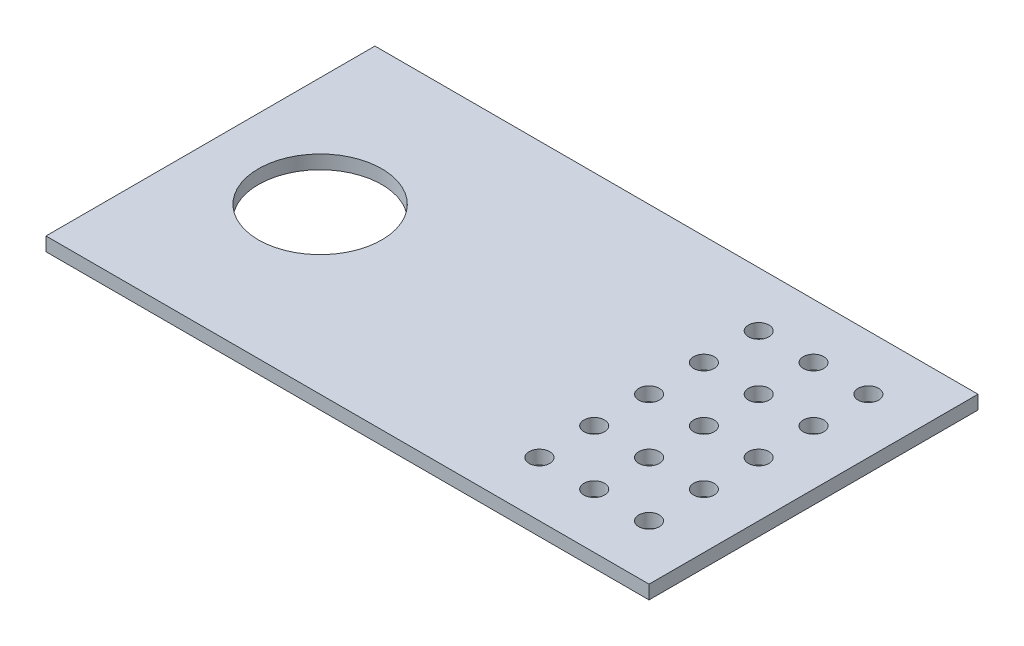
ISO-10303-21;
HEADER;
FILE_DESCRIPTION(('STEP AP214'),'2;1');
FILE_NAME('part.step','',(''),(''),'','','');
FILE_SCHEMA(('AUTOMOTIVE_DESIGN { 1 0 10303 214 1 1 1 1 }'));
ENDSEC;
DATA;
#1=APPLICATION_CONTEXT('core data for automotive mechanical design processes');
#2=APPLICATION_PROTOCOL_DEFINITION('international standard','automotive_design',2000,#1);
#3=PRODUCT_CONTEXT('',#1,'mechanical');
#4=PRODUCT('Part','Part','',(#3));
#5=PRODUCT_RELATED_PRODUCT_CATEGORY('part','',(#4));
#6=PRODUCT_DEFINITION_FORMATION('','',#4);
#7=PRODUCT_DEFINITION_CONTEXT('part definition',#1,'design');
#8=PRODUCT_DEFINITION('design','',#6,#7);
#9=PRODUCT_DEFINITION_SHAPE('','',#8);
#10=(LENGTH_UNIT() NAMED_UNIT(*) SI_UNIT(.MILLI.,.METRE.));
#11=(NAMED_UNIT(*) PLANE_ANGLE_UNIT() SI_UNIT($,.RADIAN.));
#12=(NAMED_UNIT(*) SI_UNIT($,.STERADIAN.) SOLID_ANGLE_UNIT());
#13=UNCERTAINTY_MEASURE_WITH_UNIT(LENGTH_MEASURE(1.E-05),#10,'distance_accuracy_value','');
#14=(GEOMETRIC_REPRESENTATION_CONTEXT(3) GLOBAL_UNCERTAINTY_ASSIGNED_CONTEXT((#13)) GLOBAL_UNIT_ASSIGNED_CONTEXT((#10,
#11,#12)) REPRESENTATION_CONTEXT('',''));
#15=CARTESIAN_POINT('',(0.,0.,0.));
#16=DIRECTION('',(0.,0.,1.));
#17=DIRECTION('',(1.,0.,0.));
#18=AXIS2_PLACEMENT_3D('',#15,#16,#17);
#19=CARTESIAN_POINT('',(0.,3.175,0.));
#20=DIRECTION('',(0.,1.,0.));
#21=DIRECTION('',(0.,0.,1.));
#22=AXIS2_PLACEMENT_3D('',#19,#20,#21);
#23=PLANE('',#22);
#24=CARTESIAN_POINT('',(-38.1,3.175,-50.8));
#25=DIRECTION('',(0.,1.,0.));
#26=DIRECTION('',(0.,0.,1.));
#27=AXIS2_PLACEMENT_3D('',#24,#25,#26);
#28=CIRCLE('',#27,2.38125);
#29=CARTESIAN_POINT('',(-38.1,3.175,-48.41875));
#30=VERTEX_POINT('',#29);
#31=EDGE_CURVE('E198',#30,#30,#28,.T.);
#32=ORIENTED_EDGE('',*,*,#31,.F.);
#33=EDGE_LOOP('',(#32));
#34=FACE_BOUND('',#33,.T.);
#35=CARTESIAN_POINT('',(-38.1,3.175,-25.4));
#36=DIRECTION('',(0.,1.,0.));
#37=DIRECTION('',(0.,0.,1.));
#38=AXIS2_PLACEMENT_3D('',#35,#36,#37);
#39=CIRCLE('',#38,2.38125);
#40=CARTESIAN_POINT('',(-38.1,3.175,-23.01875));
#41=VERTEX_POINT('',#40);
#42=EDGE_CURVE('E186',#41,#41,#39,.T.);
#43=ORIENTED_EDGE('',*,*,#42,.F.);
#44=EDGE_LOOP('',(#43));
#45=FACE_BOUND('',#44,.T.);
#46=CARTESIAN_POINT('',(-25.4,3.175,-63.5));
#47=DIRECTION('',(0.,1.,0.));
#48=DIRECTION('',(0.,0.,1.));
#49=AXIS2_PLACEMENT_3D('',#46,#47,#48);
#50=CIRCLE('',#49,2.38125);
#51=CARTESIAN_POINT('',(-25.4,3.175,-61.11875));
#52=VERTEX_POINT('',#51);
#53=EDGE_CURVE('E174',#52,#52,#50,.T.);
#54=ORIENTED_EDGE('',*,*,#53,.F.);
#55=EDGE_LOOP('',(#54));
#56=FACE_BOUND('',#55,.T.);
#57=CARTESIAN_POINT('',(-25.4,3.175,-50.8));
#58=DIRECTION('',(0.,1.,0.));
#59=DIRECTION('',(0.,0.,1.));
#60=AXIS2_PLACEMENT_3D('',#57,#58,#59);
#61=CIRCLE('',#60,2.38125);
#62=CARTESIAN_POINT('',(-25.4,3.175,-48.41875));
#63=VERTEX_POINT('',#62);
#64=EDGE_CURVE('E162',#63,#63,#61,.T.);
#65=ORIENTED_EDGE('',*,*,#64,.F.);
#66=EDGE_LOOP('',(#65));
#67=FACE_BOUND('',#66,.T.);
#68=CARTESIAN_POINT('',(-25.4,3.175,-38.1));
#69=DIRECTION('',(0.,1.,0.));
#70=DIRECTION('',(0.,0.,1.));
#71=AXIS2_PLACEMENT_3D('',#68,#69,#70);
#72=CIRCLE('',#71,2.38125);
#73=CARTESIAN_POINT('',(-25.4,3.175,-35.71875));
#74=VERTEX_POINT('',#73);
#75=EDGE_CURVE('E150',#74,#74,#72,.T.);
#76=ORIENTED_EDGE('',*,*,#75,.F.);
#77=EDGE_LOOP('',(#76));
#78=FACE_BOUND('',#77,.T.);
#79=CARTESIAN_POINT('',(-25.4,3.175,-25.4));
#80=DIRECTION('',(0.,1.,0.));
#81=DIRECTION('',(0.,0.,1.));
#82=AXIS2_PLACEMENT_3D('',#79,#80,#81);
#83=CIRCLE('',#82,2.38125);
#84=CARTESIAN_POINT('',(-25.4,3.175,-23.01875));
#85=VERTEX_POINT('',#84);
#86=EDGE_CURVE('E138',#85,#85,#83,.T.);
#87=ORIENTED_EDGE('',*,*,#86,.F.);
#88=EDGE_LOOP('',(#87));
#89=FACE_BOUND('',#88,.T.);
#90=CARTESIAN_POINT('',(-25.4,3.175,-12.7));
#91=DIRECTION('',(0.,1.,0.));
#92=DIRECTION('',(0.,0.,1.));
#93=AXIS2_PLACEMENT_3D('',#90,#91,#92);
#94=CIRCLE('',#93,2.38125);
#95=CARTESIAN_POINT('',(-25.4,3.175,-10.31875));
#96=VERTEX_POINT('',#95);
#97=EDGE_CURVE('E126',#96,#96,#94,.T.);
#98=ORIENTED_EDGE('',*,*,#97,.F.);
#99=EDGE_LOOP('',(#98));
#100=FACE_BOUND('',#99,.T.);
#101=CARTESIAN_POINT('',(-38.1,3.175,-12.7));
#102=DIRECTION('',(0.,1.,0.));
#103=DIRECTION('',(0.,0.,1.));
#104=AXIS2_PLACEMENT_3D('',#101,#102,#103);
#105=CIRCLE('',#104,2.38125);
#106=CARTESIAN_POINT('',(-38.1,3.175,-10.31875));
#107=VERTEX_POINT('',#106);
#108=EDGE_CURVE('E105',#107,#107,#105,.T.);
#109=ORIENTED_EDGE('',*,*,#108,.F.);
#110=EDGE_LOOP('',(#109));
#111=FACE_BOUND('',#110,.T.);
#112=DIRECTION('',(0.,0.,-1.));
#113=VECTOR('',#112,1.);
#114=CARTESIAN_POINT('',(0.,3.175,0.));
#115=LINE('',#114,#113);
#116=CARTESIAN_POINT('',(0.,3.175,0.));
#117=VERTEX_POINT('',#116);
#118=CARTESIAN_POINT('',(0.,3.175,-76.2));
#119=VERTEX_POINT('',#118);
#120=EDGE_CURVE('E90',#117,#119,#115,.T.);
#121=ORIENTED_EDGE('',*,*,#120,.T.);
#122=DIRECTION('',(-1.,0.,0.));
#123=VECTOR('',#122,1.);
#124=CARTESIAN_POINT('',(0.,3.175,-76.2));
#125=LINE('',#124,#123);
#126=CARTESIAN_POINT('',(-139.7,3.175,-76.2));
#127=VERTEX_POINT('',#126);
#128=EDGE_CURVE('E85',#119,#127,#125,.T.);
#129=ORIENTED_EDGE('',*,*,#128,.T.);
#130=DIRECTION('',(0.,0.,1.));
#131=VECTOR('',#130,1.);
#132=CARTESIAN_POINT('',(-139.7,3.175,0.));
#133=LINE('',#132,#131);
#134=CARTESIAN_POINT('',(-139.7,3.175,0.));
#135=VERTEX_POINT('',#134);
#136=EDGE_CURVE('E88',#127,#135,#133,.T.);
#137=ORIENTED_EDGE('',*,*,#136,.T.);
#138=DIRECTION('',(1.,0.,0.));
#139=VECTOR('',#138,1.);
#140=CARTESIAN_POINT('',(0.,3.175,0.));
#141=LINE('',#140,#139);
#142=EDGE_CURVE('E55',#135,#117,#141,.T.);
#143=ORIENTED_EDGE('',*,*,#142,.T.);
#144=EDGE_LOOP('',(#121,#129,#137,#143));
#145=FACE_BOUND('',#144,.T.);
#146=CARTESIAN_POINT('',(-114.3,3.175,-38.1));
#147=DIRECTION('',(0.,1.,0.));
#148=DIRECTION('',(0.,0.,1.));
#149=AXIS2_PLACEMENT_3D('',#146,#147,#148);
#150=CIRCLE('',#149,14.2875);
#151=CARTESIAN_POINT('',(-114.3,3.175,-23.8125));
#152=VERTEX_POINT('',#151);
#153=EDGE_CURVE('E120',#152,#152,#150,.T.);
#154=ORIENTED_EDGE('',*,*,#153,.F.);
#155=EDGE_LOOP('',(#154));
#156=FACE_BOUND('',#155,.T.);
#157=CARTESIAN_POINT('',(-12.7,3.175,-12.7));
#158=DIRECTION('',(0.,1.,0.));
#159=DIRECTION('',(0.,0.,1.));
#160=AXIS2_PLACEMENT_3D('',#157,#158,#159);
#161=CIRCLE('',#160,2.38125);
#162=CARTESIAN_POINT('',(-12.7,3.175,-10.31875));
#163=VERTEX_POINT('',#162);
#164=EDGE_CURVE('E132',#163,#163,#161,.T.);
#165=ORIENTED_EDGE('',*,*,#164,.F.);
#166=EDGE_LOOP('',(#165));
#167=FACE_BOUND('',#166,.T.);
#168=CARTESIAN_POINT('',(-12.7,3.175,-25.4));
#169=DIRECTION('',(0.,1.,0.));
#170=DIRECTION('',(0.,0.,1.));
#171=AXIS2_PLACEMENT_3D('',#168,#169,#170);
#172=CIRCLE('',#171,2.38125);
#173=CARTESIAN_POINT('',(-12.7,3.175,-23.01875));
#174=VERTEX_POINT('',#173);
#175=EDGE_CURVE('E144',#174,#174,#172,.T.);
#176=ORIENTED_EDGE('',*,*,#175,.F.);
#177=EDGE_LOOP('',(#176));
#178=FACE_BOUND('',#177,.T.);
#179=CARTESIAN_POINT('',(-12.7,3.175,-38.1));
#180=DIRECTION('',(0.,1.,0.));
#181=DIRECTION('',(0.,0.,1.));
#182=AXIS2_PLACEMENT_3D('',#179,#180,#181);
#183=CIRCLE('',#182,2.38125);
#184=CARTESIAN_POINT('',(-12.7,3.175,-35.71875));
#185=VERTEX_POINT('',#184);
#186=EDGE_CURVE('E156',#185,#185,#183,.T.);
#187=ORIENTED_EDGE('',*,*,#186,.F.);
#188=EDGE_LOOP('',(#187));
#189=FACE_BOUND('',#188,.T.);
#190=CARTESIAN_POINT('',(-12.7,3.175,-50.8));
#191=DIRECTION('',(0.,1.,0.));
#192=DIRECTION('',(0.,0.,1.));
#193=AXIS2_PLACEMENT_3D('',#190,#191,#192);
#194=CIRCLE('',#193,2.38125);
#195=CARTESIAN_POINT('',(-12.7,3.175,-48.41875));
#196=VERTEX_POINT('',#195);
#197=EDGE_CURVE('E168',#196,#196,#194,.T.);
#198=ORIENTED_EDGE('',*,*,#197,.F.);
#199=EDGE_LOOP('',(#198));
#200=FACE_BOUND('',#199,.T.);
#201=CARTESIAN_POINT('',(-12.7,3.175,-63.5));
#202=DIRECTION('',(0.,1.,0.));
#203=DIRECTION('',(0.,0.,1.));
#204=AXIS2_PLACEMENT_3D('',#201,#202,#203);
#205=CIRCLE('',#204,2.38125);
#206=CARTESIAN_POINT('',(-12.7,3.175,-61.11875));
#207=VERTEX_POINT('',#206);
#208=EDGE_CURVE('E180',#207,#207,#205,.T.);
#209=ORIENTED_EDGE('',*,*,#208,.F.);
#210=EDGE_LOOP('',(#209));
#211=FACE_BOUND('',#210,.T.);
#212=CARTESIAN_POINT('',(-38.1,3.175,-38.1));
#213=DIRECTION('',(0.,1.,0.));
#214=DIRECTION('',(0.,0.,1.));
#215=AXIS2_PLACEMENT_3D('',#212,#213,#214);
#216=CIRCLE('',#215,2.38125);
#217=CARTESIAN_POINT('',(-38.1,3.175,-35.71875));
#218=VERTEX_POINT('',#217);
#219=EDGE_CURVE('E192',#218,#218,#216,.T.);
#220=ORIENTED_EDGE('',*,*,#219,.F.);
#221=EDGE_LOOP('',(#220));
#222=FACE_BOUND('',#221,.T.);
#223=CARTESIAN_POINT('',(-38.1,3.175,-63.5));
#224=DIRECTION('',(0.,1.,0.));
#225=DIRECTION('',(0.,0.,1.));
#226=AXIS2_PLACEMENT_3D('',#223,#224,#225);
#227=CIRCLE('',#226,2.38125);
#228=CARTESIAN_POINT('',(-38.1,3.175,-61.11875));
#229=VERTEX_POINT('',#228);
#230=EDGE_CURVE('E204',#229,#229,#227,.T.);
#231=ORIENTED_EDGE('',*,*,#230,.F.);
#232=EDGE_LOOP('',(#231));
#233=FACE_BOUND('',#232,.T.);
#234=ADVANCED_FACE('F38',(#34,#45,#56,#67,#78,#89,#100,#111,#145,#156,#167,#178,#189,#200,#211,
#222,#233),#23,.T.);
#235=CARTESIAN_POINT('',(0.,0.,0.));
#236=DIRECTION('',(0.,1.,0.));
#237=DIRECTION('',(0.,0.,1.));
#238=AXIS2_PLACEMENT_3D('',#235,#236,#237);
#239=PLANE('',#238);
#240=DIRECTION('',(0.,0.,-1.));
#241=VECTOR('',#240,1.);
#242=CARTESIAN_POINT('',(0.,0.,0.));
#243=LINE('',#242,#241);
#244=CARTESIAN_POINT('',(0.,0.,0.));
#245=VERTEX_POINT('',#244);
#246=CARTESIAN_POINT('',(0.,0.,-76.2));
#247=VERTEX_POINT('',#246);
#248=EDGE_CURVE('E102',#245,#247,#243,.T.);
#249=ORIENTED_EDGE('',*,*,#248,.F.);
#250=DIRECTION('',(1.,0.,0.));
#251=VECTOR('',#250,1.);
#252=CARTESIAN_POINT('',(0.,0.,0.));
#253=LINE('',#252,#251);
#254=CARTESIAN_POINT('',(-139.7,0.,0.));
#255=VERTEX_POINT('',#254);
#256=EDGE_CURVE('E78',#255,#245,#253,.T.);
#257=ORIENTED_EDGE('',*,*,#256,.F.);
#258=DIRECTION('',(0.,0.,1.));
#259=VECTOR('',#258,1.);
#260=CARTESIAN_POINT('',(-139.7,0.,0.));
#261=LINE('',#260,#259);
#262=CARTESIAN_POINT('',(-139.7,0.,-76.2));
#263=VERTEX_POINT('',#262);
#264=EDGE_CURVE('E72',#263,#255,#261,.T.);
#265=ORIENTED_EDGE('',*,*,#264,.F.);
#266=DIRECTION('',(-1.,0.,0.));
#267=VECTOR('',#266,1.);
#268=CARTESIAN_POINT('',(0.,0.,-76.2));
#269=LINE('',#268,#267);
#270=EDGE_CURVE('E94',#247,#263,#269,.T.);
#271=ORIENTED_EDGE('',*,*,#270,.F.);
#272=EDGE_LOOP('',(#249,#257,#265,#271));
#273=FACE_BOUND('',#272,.T.);
#274=CARTESIAN_POINT('',(-38.1,0.,-12.7));
#275=DIRECTION('',(0.,1.,0.));
#276=DIRECTION('',(0.,0.,1.));
#277=AXIS2_PLACEMENT_3D('',#274,#275,#276);
#278=CIRCLE('',#277,2.38125);
#279=CARTESIAN_POINT('',(-38.1,0.,-10.31875));
#280=VERTEX_POINT('',#279);
#281=EDGE_CURVE('E117',#280,#280,#278,.T.);
#282=ORIENTED_EDGE('',*,*,#281,.T.);
#283=EDGE_LOOP('',(#282));
#284=FACE_BOUND('',#283,.T.);
#285=CARTESIAN_POINT('',(-114.3,0.,-38.1));
#286=DIRECTION('',(0.,1.,0.));
#287=DIRECTION('',(0.,0.,1.));
#288=AXIS2_PLACEMENT_3D('',#285,#286,#287);
#289=CIRCLE('',#288,14.2875);
#290=CARTESIAN_POINT('',(-114.3,0.,-23.8125));
#291=VERTEX_POINT('',#290);
#292=EDGE_CURVE('E123',#291,#291,#289,.T.);
#293=ORIENTED_EDGE('',*,*,#292,.T.);
#294=EDGE_LOOP('',(#293));
#295=FACE_BOUND('',#294,.T.);
#296=CARTESIAN_POINT('',(-25.4,0.,-12.7));
#297=DIRECTION('',(0.,1.,0.));
#298=DIRECTION('',(0.,0.,1.));
#299=AXIS2_PLACEMENT_3D('',#296,#297,#298);
#300=CIRCLE('',#299,2.38125);
#301=CARTESIAN_POINT('',(-25.4,0.,-10.31875));
#302=VERTEX_POINT('',#301);
#303=EDGE_CURVE('E129',#302,#302,#300,.T.);
#304=ORIENTED_EDGE('',*,*,#303,.T.);
#305=EDGE_LOOP('',(#304));
#306=FACE_BOUND('',#305,.T.);
#307=CARTESIAN_POINT('',(-12.7,0.,-12.7));
#308=DIRECTION('',(0.,1.,0.));
#309=DIRECTION('',(0.,0.,1.));
#310=AXIS2_PLACEMENT_3D('',#307,#308,#309);
#311=CIRCLE('',#310,2.38125);
#312=CARTESIAN_POINT('',(-12.7,0.,-10.31875));
#313=VERTEX_POINT('',#312);
#314=EDGE_CURVE('E135',#313,#313,#311,.T.);
#315=ORIENTED_EDGE('',*,*,#314,.T.);
#316=EDGE_LOOP('',(#315));
#317=FACE_BOUND('',#316,.T.);
#318=CARTESIAN_POINT('',(-25.4,0.,-25.4));
#319=DIRECTION('',(0.,1.,0.));
#320=DIRECTION('',(0.,0.,1.));
#321=AXIS2_PLACEMENT_3D('',#318,#319,#320);
#322=CIRCLE('',#321,2.38125);
#323=CARTESIAN_POINT('',(-25.4,0.,-23.01875));
#324=VERTEX_POINT('',#323);
#325=EDGE_CURVE('E141',#324,#324,#322,.T.);
#326=ORIENTED_EDGE('',*,*,#325,.T.);
#327=EDGE_LOOP('',(#326));
#328=FACE_BOUND('',#327,.T.);
#329=CARTESIAN_POINT('',(-12.7,0.,-25.4));
#330=DIRECTION('',(0.,1.,0.));
#331=DIRECTION('',(0.,0.,1.));
#332=AXIS2_PLACEMENT_3D('',#329,#330,#331);
#333=CIRCLE('',#332,2.38125);
#334=CARTESIAN_POINT('',(-12.7,0.,-23.01875));
#335=VERTEX_POINT('',#334);
#336=EDGE_CURVE('E147',#335,#335,#333,.T.);
#337=ORIENTED_EDGE('',*,*,#336,.T.);
#338=EDGE_LOOP('',(#337));
#339=FACE_BOUND('',#338,.T.);
#340=CARTESIAN_POINT('',(-25.4,0.,-38.1));
#341=DIRECTION('',(0.,1.,0.));
#342=DIRECTION('',(0.,0.,1.));
#343=AXIS2_PLACEMENT_3D('',#340,#341,#342);
#344=CIRCLE('',#343,2.38125);
#345=CARTESIAN_POINT('',(-25.4,0.,-35.71875));
#346=VERTEX_POINT('',#345);
#347=EDGE_CURVE('E153',#346,#346,#344,.T.);
#348=ORIENTED_EDGE('',*,*,#347,.T.);
#349=EDGE_LOOP('',(#348));
#350=FACE_BOUND('',#349,.T.);
#351=CARTESIAN_POINT('',(-12.7,0.,-38.1));
#352=DIRECTION('',(0.,1.,0.));
#353=DIRECTION('',(0.,0.,1.));
#354=AXIS2_PLACEMENT_3D('',#351,#352,#353);
#355=CIRCLE('',#354,2.38125);
#356=CARTESIAN_POINT('',(-12.7,0.,-35.71875));
#357=VERTEX_POINT('',#356);
#358=EDGE_CURVE('E159',#357,#357,#355,.T.);
#359=ORIENTED_EDGE('',*,*,#358,.T.);
#360=EDGE_LOOP('',(#359));
#361=FACE_BOUND('',#360,.T.);
#362=CARTESIAN_POINT('',(-25.4,0.,-50.8));
#363=DIRECTION('',(0.,1.,0.));
#364=DIRECTION('',(0.,0.,1.));
#365=AXIS2_PLACEMENT_3D('',#362,#363,#364);
#366=CIRCLE('',#365,2.38125);
#367=CARTESIAN_POINT('',(-25.4,0.,-48.41875));
#368=VERTEX_POINT('',#367);
#369=EDGE_CURVE('E165',#368,#368,#366,.T.);
#370=ORIENTED_EDGE('',*,*,#369,.T.);
#371=EDGE_LOOP('',(#370));
#372=FACE_BOUND('',#371,.T.);
#373=CARTESIAN_POINT('',(-12.7,0.,-50.8));
#374=DIRECTION('',(0.,1.,0.));
#375=DIRECTION('',(0.,0.,1.));
#376=AXIS2_PLACEMENT_3D('',#373,#374,#375);
#377=CIRCLE('',#376,2.38125);
#378=CARTESIAN_POINT('',(-12.7,0.,-48.41875));
#379=VERTEX_POINT('',#378);
#380=EDGE_CURVE('E171',#379,#379,#377,.T.);
#381=ORIENTED_EDGE('',*,*,#380,.T.);
#382=EDGE_LOOP('',(#381));
#383=FACE_BOUND('',#382,.T.);
#384=CARTESIAN_POINT('',(-25.4,0.,-63.5));
#385=DIRECTION('',(0.,1.,0.));
#386=DIRECTION('',(0.,0.,1.));
#387=AXIS2_PLACEMENT_3D('',#384,#385,#386);
#388=CIRCLE('',#387,2.38125);
#389=CARTESIAN_POINT('',(-25.4,0.,-61.11875));
#390=VERTEX_POINT('',#389);
#391=EDGE_CURVE('E177',#390,#390,#388,.T.);
#392=ORIENTED_EDGE('',*,*,#391,.T.);
#393=EDGE_LOOP('',(#392));
#394=FACE_BOUND('',#393,.T.);
#395=CARTESIAN_POINT('',(-12.7,0.,-63.5));
#396=DIRECTION('',(0.,1.,0.));
#397=DIRECTION('',(0.,0.,1.));
#398=AXIS2_PLACEMENT_3D('',#395,#396,#397);
#399=CIRCLE('',#398,2.38125);
#400=CARTESIAN_POINT('',(-12.7,0.,-61.11875));
#401=VERTEX_POINT('',#400);
#402=EDGE_CURVE('E183',#401,#401,#399,.T.);
#403=ORIENTED_EDGE('',*,*,#402,.T.);
#404=EDGE_LOOP('',(#403));
#405=FACE_BOUND('',#404,.T.);
#406=CARTESIAN_POINT('',(-38.1,0.,-25.4));
#407=DIRECTION('',(0.,1.,0.));
#408=DIRECTION('',(0.,0.,1.));
#409=AXIS2_PLACEMENT_3D('',#406,#407,#408);
#410=CIRCLE('',#409,2.38125);
#411=CARTESIAN_POINT('',(-38.1,0.,-23.01875));
#412=VERTEX_POINT('',#411);
#413=EDGE_CURVE('E189',#412,#412,#410,.T.);
#414=ORIENTED_EDGE('',*,*,#413,.T.);
#415=EDGE_LOOP('',(#414));
#416=FACE_BOUND('',#415,.T.);
#417=CARTESIAN_POINT('',(-38.1,0.,-38.1));
#418=DIRECTION('',(0.,1.,0.));
#419=DIRECTION('',(0.,0.,1.));
#420=AXIS2_PLACEMENT_3D('',#417,#418,#419);
#421=CIRCLE('',#420,2.38125);
#422=CARTESIAN_POINT('',(-38.1,0.,-35.71875));
#423=VERTEX_POINT('',#422);
#424=EDGE_CURVE('E195',#423,#423,#421,.T.);
#425=ORIENTED_EDGE('',*,*,#424,.T.);
#426=EDGE_LOOP('',(#425));
#427=FACE_BOUND('',#426,.T.);
#428=CARTESIAN_POINT('',(-38.1,0.,-50.8));
#429=DIRECTION('',(0.,1.,0.));
#430=DIRECTION('',(0.,0.,1.));
#431=AXIS2_PLACEMENT_3D('',#428,#429,#430);
#432=CIRCLE('',#431,2.38125);
#433=CARTESIAN_POINT('',(-38.1,0.,-48.41875));
#434=VERTEX_POINT('',#433);
#435=EDGE_CURVE('E201',#434,#434,#432,.T.);
#436=ORIENTED_EDGE('',*,*,#435,.T.);
#437=EDGE_LOOP('',(#436));
#438=FACE_BOUND('',#437,.T.);
#439=CARTESIAN_POINT('',(-38.1,0.,-63.5));
#440=DIRECTION('',(0.,1.,0.));
#441=DIRECTION('',(0.,0.,1.));
#442=AXIS2_PLACEMENT_3D('',#439,#440,#441);
#443=CIRCLE('',#442,2.38125);
#444=CARTESIAN_POINT('',(-38.1,0.,-61.11875));
#445=VERTEX_POINT('',#444);
#446=EDGE_CURVE('E207',#445,#445,#443,.T.);
#447=ORIENTED_EDGE('',*,*,#446,.T.);
#448=EDGE_LOOP('',(#447));
#449=FACE_BOUND('',#448,.T.);
#450=ADVANCED_FACE('F113',(#273,#284,#295,#306,#317,#328,#339,#350,#361,#372,#383,#394,#405,
#416,#427,#438,#449),#239,.F.);
#451=CARTESIAN_POINT('',(0.,3.175,0.));
#452=DIRECTION('',(-1.,0.,0.));
#453=DIRECTION('',(0.,0.,1.));
#454=AXIS2_PLACEMENT_3D('',#451,#452,#453);
#455=PLANE('',#454);
#456=ORIENTED_EDGE('',*,*,#248,.T.);
#457=DIRECTION('',(0.,-1.,0.));
#458=VECTOR('',#457,1.);
#459=CARTESIAN_POINT('',(0.,3.175,-76.2));
#460=LINE('',#459,#458);
#461=EDGE_CURVE('E11',#119,#247,#460,.T.);
#462=ORIENTED_EDGE('',*,*,#461,.F.);
#463=ORIENTED_EDGE('',*,*,#120,.F.);
#464=DIRECTION('',(0.,-1.,0.));
#465=VECTOR('',#464,1.);
#466=CARTESIAN_POINT('',(0.,3.175,0.));
#467=LINE('',#466,#465);
#468=EDGE_CURVE('E98',#117,#245,#467,.T.);
#469=ORIENTED_EDGE('',*,*,#468,.T.);
#470=EDGE_LOOP('',(#456,#462,#463,#469));
#471=FACE_BOUND('',#470,.T.);
#472=ADVANCED_FACE('F40',(#471),#455,.F.);
#473=CARTESIAN_POINT('',(0.,3.175,-76.2));
#474=DIRECTION('',(0.,0.,1.));
#475=DIRECTION('',(1.,0.,0.));
#476=AXIS2_PLACEMENT_3D('',#473,#474,#475);
#477=PLANE('',#476);
#478=ORIENTED_EDGE('',*,*,#270,.T.);
#479=DIRECTION('',(0.,-1.,0.));
#480=VECTOR('',#479,1.);
#481=CARTESIAN_POINT('',(-139.7,3.175,-76.2));
#482=LINE('',#481,#480);
#483=EDGE_CURVE('E47',#127,#263,#482,.T.);
#484=ORIENTED_EDGE('',*,*,#483,.F.);
#485=ORIENTED_EDGE('',*,*,#128,.F.);
#486=ORIENTED_EDGE('',*,*,#461,.T.);
#487=EDGE_LOOP('',(#478,#484,#485,#486));
#488=FACE_BOUND('',#487,.T.);
#489=ADVANCED_FACE('F93',(#488),#477,.F.);
#490=CARTESIAN_POINT('',(-139.7,3.175,0.));
#491=DIRECTION('',(1.,0.,0.));
#492=DIRECTION('',(0.,0.,-1.));
#493=AXIS2_PLACEMENT_3D('',#490,#491,#492);
#494=PLANE('',#493);
#495=ORIENTED_EDGE('',*,*,#264,.T.);
#496=DIRECTION('',(0.,-1.,0.));
#497=VECTOR('',#496,1.);
#498=CARTESIAN_POINT('',(-139.7,3.175,0.));
#499=LINE('',#498,#497);
#500=EDGE_CURVE('E95',#135,#255,#499,.T.);
#501=ORIENTED_EDGE('',*,*,#500,.F.);
#502=ORIENTED_EDGE('',*,*,#136,.F.);
#503=ORIENTED_EDGE('',*,*,#483,.T.);
#504=EDGE_LOOP('',(#495,#501,#502,#503));
#505=FACE_BOUND('',#504,.T.);
#506=ADVANCED_FACE('F96',(#505),#494,.F.);
#507=CARTESIAN_POINT('',(0.,3.175,0.));
#508=DIRECTION('',(0.,0.,-1.));
#509=DIRECTION('',(-1.,0.,0.));
#510=AXIS2_PLACEMENT_3D('',#507,#508,#509);
#511=PLANE('',#510);
#512=ORIENTED_EDGE('',*,*,#256,.T.);
#513=ORIENTED_EDGE('',*,*,#468,.F.);
#514=ORIENTED_EDGE('',*,*,#142,.F.);
#515=ORIENTED_EDGE('',*,*,#500,.T.);
#516=EDGE_LOOP('',(#512,#513,#514,#515));
#517=FACE_BOUND('',#516,.T.);
#518=ADVANCED_FACE('F110',(#517),#511,.F.);
#519=CARTESIAN_POINT('',(-38.1,3.175,-12.7));
#520=DIRECTION('',(0.,-1.,0.));
#521=DIRECTION('',(0.,0.,-1.));
#522=AXIS2_PLACEMENT_3D('',#519,#520,#521);
#523=CYLINDRICAL_SURFACE('',#522,2.38125);
#524=ORIENTED_EDGE('',*,*,#108,.T.);
#525=EDGE_LOOP('',(#524));
#526=FACE_BOUND('',#525,.T.);
#527=ORIENTED_EDGE('',*,*,#281,.F.);
#528=EDGE_LOOP('',(#527));
#529=FACE_BOUND('',#528,.T.);
#530=ADVANCED_FACE('F226',(#526,#529),#523,.F.);
#531=CARTESIAN_POINT('',(-114.3,3.175,-38.1));
#532=DIRECTION('',(0.,-1.,0.));
#533=DIRECTION('',(0.,0.,-1.));
#534=AXIS2_PLACEMENT_3D('',#531,#532,#533);
#535=CYLINDRICAL_SURFACE('',#534,14.2875);
#536=ORIENTED_EDGE('',*,*,#153,.T.);
#537=EDGE_LOOP('',(#536));
#538=FACE_BOUND('',#537,.T.);
#539=ORIENTED_EDGE('',*,*,#292,.F.);
#540=EDGE_LOOP('',(#539));
#541=FACE_BOUND('',#540,.T.);
#542=ADVANCED_FACE('F271',(#538,#541),#535,.F.);
#543=CARTESIAN_POINT('',(-25.4,3.175,-12.7));
#544=DIRECTION('',(0.,-1.,0.));
#545=DIRECTION('',(0.,0.,-1.));
#546=AXIS2_PLACEMENT_3D('',#543,#544,#545);
#547=CYLINDRICAL_SURFACE('',#546,2.38125);
#548=ORIENTED_EDGE('',*,*,#97,.T.);
#549=EDGE_LOOP('',(#548));
#550=FACE_BOUND('',#549,.T.);
#551=ORIENTED_EDGE('',*,*,#303,.F.);
#552=EDGE_LOOP('',(#551));
#553=FACE_BOUND('',#552,.T.);
#554=ADVANCED_FACE('F279',(#550,#553),#547,.F.);
#555=CARTESIAN_POINT('',(-12.7,3.175,-12.7));
#556=DIRECTION('',(0.,-1.,0.));
#557=DIRECTION('',(0.,0.,-1.));
#558=AXIS2_PLACEMENT_3D('',#555,#556,#557);
#559=CYLINDRICAL_SURFACE('',#558,2.38125);
#560=ORIENTED_EDGE('',*,*,#164,.T.);
#561=EDGE_LOOP('',(#560));
#562=FACE_BOUND('',#561,.T.);
#563=ORIENTED_EDGE('',*,*,#314,.F.);
#564=EDGE_LOOP('',(#563));
#565=FACE_BOUND('',#564,.T.);
#566=ADVANCED_FACE('F287',(#562,#565),#559,.F.);
#567=CARTESIAN_POINT('',(-25.4,3.175,-25.4));
#568=DIRECTION('',(0.,-1.,0.));
#569=DIRECTION('',(0.,0.,-1.));
#570=AXIS2_PLACEMENT_3D('',#567,#568,#569);
#571=CYLINDRICAL_SURFACE('',#570,2.38125);
#572=ORIENTED_EDGE('',*,*,#86,.T.);
#573=EDGE_LOOP('',(#572));
#574=FACE_BOUND('',#573,.T.);
#575=ORIENTED_EDGE('',*,*,#325,.F.);
#576=EDGE_LOOP('',(#575));
#577=FACE_BOUND('',#576,.T.);
#578=ADVANCED_FACE('F296',(#574,#577),#571,.F.);
#579=CARTESIAN_POINT('',(-12.7,3.175,-25.4));
#580=DIRECTION('',(0.,-1.,0.));
#581=DIRECTION('',(0.,0.,-1.));
#582=AXIS2_PLACEMENT_3D('',#579,#580,#581);
#583=CYLINDRICAL_SURFACE('',#582,2.38125);
#584=ORIENTED_EDGE('',*,*,#175,.T.);
#585=EDGE_LOOP('',(#584));
#586=FACE_BOUND('',#585,.T.);
#587=ORIENTED_EDGE('',*,*,#336,.F.);
#588=EDGE_LOOP('',(#587));
#589=FACE_BOUND('',#588,.T.);
#590=ADVANCED_FACE('F305',(#586,#589),#583,.F.);
#591=CARTESIAN_POINT('',(-25.4,3.175,-38.1));
#592=DIRECTION('',(0.,-1.,0.));
#593=DIRECTION('',(0.,0.,-1.));
#594=AXIS2_PLACEMENT_3D('',#591,#592,#593);
#595=CYLINDRICAL_SURFACE('',#594,2.38125);
#596=ORIENTED_EDGE('',*,*,#75,.T.);
#597=EDGE_LOOP('',(#596));
#598=FACE_BOUND('',#597,.T.);
#599=ORIENTED_EDGE('',*,*,#347,.F.);
#600=EDGE_LOOP('',(#599));
#601=FACE_BOUND('',#600,.T.);
#602=ADVANCED_FACE('F314',(#598,#601),#595,.F.);
#603=CARTESIAN_POINT('',(-12.7,3.175,-38.1));
#604=DIRECTION('',(0.,-1.,0.));
#605=DIRECTION('',(0.,0.,-1.));
#606=AXIS2_PLACEMENT_3D('',#603,#604,#605);
#607=CYLINDRICAL_SURFACE('',#606,2.38125);
#608=ORIENTED_EDGE('',*,*,#186,.T.);
#609=EDGE_LOOP('',(#608));
#610=FACE_BOUND('',#609,.T.);
#611=ORIENTED_EDGE('',*,*,#358,.F.);
#612=EDGE_LOOP('',(#611));
#613=FACE_BOUND('',#612,.T.);
#614=ADVANCED_FACE('F323',(#610,#613),#607,.F.);
#615=CARTESIAN_POINT('',(-25.4,3.175,-50.8));
#616=DIRECTION('',(0.,-1.,0.));
#617=DIRECTION('',(0.,0.,-1.));
#618=AXIS2_PLACEMENT_3D('',#615,#616,#617);
#619=CYLINDRICAL_SURFACE('',#618,2.38125);
#620=ORIENTED_EDGE('',*,*,#64,.T.);
#621=EDGE_LOOP('',(#620));
#622=FACE_BOUND('',#621,.T.);
#623=ORIENTED_EDGE('',*,*,#369,.F.);
#624=EDGE_LOOP('',(#623));
#625=FACE_BOUND('',#624,.T.);
#626=ADVANCED_FACE('F332',(#622,#625),#619,.F.);
#627=CARTESIAN_POINT('',(-12.7,3.175,-50.8));
#628=DIRECTION('',(0.,-1.,0.));
#629=DIRECTION('',(0.,0.,-1.));
#630=AXIS2_PLACEMENT_3D('',#627,#628,#629);
#631=CYLINDRICAL_SURFACE('',#630,2.38125);
#632=ORIENTED_EDGE('',*,*,#197,.T.);
#633=EDGE_LOOP('',(#632));
#634=FACE_BOUND('',#633,.T.);
#635=ORIENTED_EDGE('',*,*,#380,.F.);
#636=EDGE_LOOP('',(#635));
#637=FACE_BOUND('',#636,.T.);
#638=ADVANCED_FACE('F341',(#634,#637),#631,.F.);
#639=CARTESIAN_POINT('',(-25.4,3.175,-63.5));
#640=DIRECTION('',(0.,-1.,0.));
#641=DIRECTION('',(0.,0.,-1.));
#642=AXIS2_PLACEMENT_3D('',#639,#640,#641);
#643=CYLINDRICAL_SURFACE('',#642,2.38125);
#644=ORIENTED_EDGE('',*,*,#53,.T.);
#645=EDGE_LOOP('',(#644));
#646=FACE_BOUND('',#645,.T.);
#647=ORIENTED_EDGE('',*,*,#391,.F.);
#648=EDGE_LOOP('',(#647));
#649=FACE_BOUND('',#648,.T.);
#650=ADVANCED_FACE('F350',(#646,#649),#643,.F.);
#651=CARTESIAN_POINT('',(-12.7,3.175,-63.5));
#652=DIRECTION('',(0.,-1.,0.));
#653=DIRECTION('',(0.,0.,-1.));
#654=AXIS2_PLACEMENT_3D('',#651,#652,#653);
#655=CYLINDRICAL_SURFACE('',#654,2.38125);
#656=ORIENTED_EDGE('',*,*,#208,.T.);
#657=EDGE_LOOP('',(#656));
#658=FACE_BOUND('',#657,.T.);
#659=ORIENTED_EDGE('',*,*,#402,.F.);
#660=EDGE_LOOP('',(#659));
#661=FACE_BOUND('',#660,.T.);
#662=ADVANCED_FACE('F359',(#658,#661),#655,.F.);
#663=CARTESIAN_POINT('',(-38.1,3.175,-25.4));
#664=DIRECTION('',(0.,-1.,0.));
#665=DIRECTION('',(0.,0.,-1.));
#666=AXIS2_PLACEMENT_3D('',#663,#664,#665);
#667=CYLINDRICAL_SURFACE('',#666,2.38125);
#668=ORIENTED_EDGE('',*,*,#42,.T.);
#669=EDGE_LOOP('',(#668));
#670=FACE_BOUND('',#669,.T.);
#671=ORIENTED_EDGE('',*,*,#413,.F.);
#672=EDGE_LOOP('',(#671));
#673=FACE_BOUND('',#672,.T.);
#674=ADVANCED_FACE('F368',(#670,#673),#667,.F.);
#675=CARTESIAN_POINT('',(-38.1,3.175,-38.1));
#676=DIRECTION('',(0.,-1.,0.));
#677=DIRECTION('',(0.,0.,-1.));
#678=AXIS2_PLACEMENT_3D('',#675,#676,#677);
#679=CYLINDRICAL_SURFACE('',#678,2.38125);
#680=ORIENTED_EDGE('',*,*,#219,.T.);
#681=EDGE_LOOP('',(#680));
#682=FACE_BOUND('',#681,.T.);
#683=ORIENTED_EDGE('',*,*,#424,.F.);
#684=EDGE_LOOP('',(#683));
#685=FACE_BOUND('',#684,.T.);
#686=ADVANCED_FACE('F377',(#682,#685),#679,.F.);
#687=CARTESIAN_POINT('',(-38.1,3.175,-50.8));
#688=DIRECTION('',(0.,-1.,0.));
#689=DIRECTION('',(0.,0.,-1.));
#690=AXIS2_PLACEMENT_3D('',#687,#688,#689);
#691=CYLINDRICAL_SURFACE('',#690,2.38125);
#692=ORIENTED_EDGE('',*,*,#31,.T.);
#693=EDGE_LOOP('',(#692));
#694=FACE_BOUND('',#693,.T.);
#695=ORIENTED_EDGE('',*,*,#435,.F.);
#696=EDGE_LOOP('',(#695));
#697=FACE_BOUND('',#696,.T.);
#698=ADVANCED_FACE('F386',(#694,#697),#691,.F.);
#699=CARTESIAN_POINT('',(-38.1,3.175,-63.5));
#700=DIRECTION('',(0.,-1.,0.));
#701=DIRECTION('',(0.,0.,-1.));
#702=AXIS2_PLACEMENT_3D('',#699,#700,#701);
#703=CYLINDRICAL_SURFACE('',#702,2.38125);
#704=ORIENTED_EDGE('',*,*,#230,.T.);
#705=EDGE_LOOP('',(#704));
#706=FACE_BOUND('',#705,.T.);
#707=ORIENTED_EDGE('',*,*,#446,.F.);
#708=EDGE_LOOP('',(#707));
#709=FACE_BOUND('',#708,.T.);
#710=ADVANCED_FACE('F213',(#706,#709),#703,.F.);
#711=CLOSED_SHELL('',(#234,#450,#472,#489,#506,#518,#530,#542,#554,#566,#578,#590,#602,#614,
#626,#638,#650,#662,#674,#686,#698,#710));
#712=MANIFOLD_SOLID_BREP('B2',#711);
#713=ADVANCED_BREP_SHAPE_REPRESENTATION('',(#18,#712),#14);
#714=SHAPE_DEFINITION_REPRESENTATION(#9,#713);
ENDSEC;
END-ISO-10303-21;
